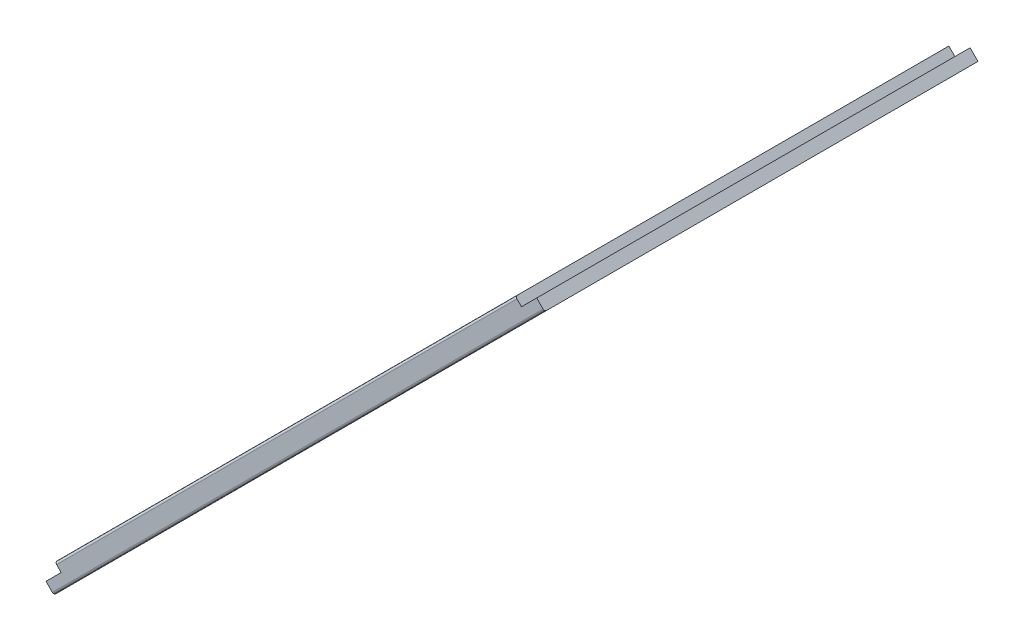
ISO-10303-21;
HEADER;
FILE_DESCRIPTION(('STEP AP214'),'2;1');
FILE_NAME('part.step','',(''),(''),'','','');
FILE_SCHEMA(('AUTOMOTIVE_DESIGN { 1 0 10303 214 1 1 1 1 }'));
ENDSEC;
DATA;
#1=APPLICATION_CONTEXT('core data for automotive mechanical design processes');
#2=APPLICATION_PROTOCOL_DEFINITION('international standard','automotive_design',2000,#1);
#3=PRODUCT_CONTEXT('',#1,'mechanical');
#4=PRODUCT('Part','Part','',(#3));
#5=PRODUCT_RELATED_PRODUCT_CATEGORY('part','',(#4));
#6=PRODUCT_DEFINITION_FORMATION('','',#4);
#7=PRODUCT_DEFINITION_CONTEXT('part definition',#1,'design');
#8=PRODUCT_DEFINITION('design','',#6,#7);
#9=PRODUCT_DEFINITION_SHAPE('','',#8);
#10=(LENGTH_UNIT() NAMED_UNIT(*) SI_UNIT(.MILLI.,.METRE.));
#11=(NAMED_UNIT(*) PLANE_ANGLE_UNIT() SI_UNIT($,.RADIAN.));
#12=(NAMED_UNIT(*) SI_UNIT($,.STERADIAN.) SOLID_ANGLE_UNIT());
#13=UNCERTAINTY_MEASURE_WITH_UNIT(LENGTH_MEASURE(1.E-05),#10,'distance_accuracy_value','');
#14=(GEOMETRIC_REPRESENTATION_CONTEXT(3) GLOBAL_UNCERTAINTY_ASSIGNED_CONTEXT((#13)) GLOBAL_UNIT_ASSIGNED_CONTEXT((#10,
#11,#12)) REPRESENTATION_CONTEXT('',''));
#15=CARTESIAN_POINT('',(0.,0.,0.));
#16=DIRECTION('',(0.,0.,1.));
#17=DIRECTION('',(1.,0.,0.));
#18=AXIS2_PLACEMENT_3D('',#15,#16,#17);
#19=CARTESIAN_POINT('',(181.793398282203,130.470353544371,8.59));
#20=DIRECTION('',(0.707106781186548,-0.707106781186548,0.));
#21=DIRECTION('',(0.707106781186548,0.707106781186548,0.));
#22=AXIS2_PLACEMENT_3D('',#19,#20,#21);
#23=PLANE('',#22);
#24=CARTESIAN_POINT('',(183.564844891609,132.241800153778,54.8));
#25=DIRECTION('',(0.707106781186548,-0.707106781186548,0.));
#26=DIRECTION('',(0.707106781186548,0.707106781186548,0.));
#27=AXIS2_PLACEMENT_3D('',#24,#25,#26);
#28=CIRCLE('',#27,2.00000000000001);
#29=CARTESIAN_POINT('',(184.979058453982,133.656013716151,54.8));
#30=VERTEX_POINT('',#29);
#31=EDGE_CURVE('E195',#30,#30,#28,.F.);
#32=ORIENTED_EDGE('',*,*,#31,.F.);
#33=EDGE_LOOP('',(#32));
#34=FACE_BOUND('',#33,.T.);
#35=CARTESIAN_POINT('',(183.564844891609,132.241800153778,27.5));
#36=DIRECTION('',(0.707106781186548,-0.707106781186548,0.));
#37=DIRECTION('',(0.707106781186548,0.707106781186548,0.));
#38=AXIS2_PLACEMENT_3D('',#35,#36,#37);
#39=CIRCLE('',#38,2.00000000000001);
#40=CARTESIAN_POINT('',(184.979058453982,133.656013716151,27.5));
#41=VERTEX_POINT('',#40);
#42=EDGE_CURVE('E198',#41,#41,#39,.F.);
#43=ORIENTED_EDGE('',*,*,#42,.F.);
#44=EDGE_LOOP('',(#43));
#45=FACE_BOUND('',#44,.T.);
#46=CARTESIAN_POINT('',(183.564844891609,132.241800153778,82.1));
#47=DIRECTION('',(0.707106781186548,-0.707106781186548,0.));
#48=DIRECTION('',(0.707106781186548,0.707106781186548,0.));
#49=AXIS2_PLACEMENT_3D('',#46,#47,#48);
#50=CIRCLE('',#49,2.);
#51=CARTESIAN_POINT('',(184.979058453982,133.656013716151,82.1));
#52=VERTEX_POINT('',#51);
#53=EDGE_CURVE('E122',#52,#52,#50,.F.);
#54=ORIENTED_EDGE('',*,*,#53,.F.);
#55=EDGE_LOOP('',(#54));
#56=FACE_BOUND('',#55,.T.);
#57=DIRECTION('',(0.,0.,1.));
#58=VECTOR('',#57,1.);
#59=CARTESIAN_POINT('',(181.793398282203,130.470353544371,8.59));
#60=LINE('',#59,#58);
#61=CARTESIAN_POINT('',(181.793398282203,130.470353544371,8.6));
#62=VERTEX_POINT('',#61);
#63=CARTESIAN_POINT('',(181.793398282203,130.470353544371,109.6));
#64=VERTEX_POINT('',#63);
#65=EDGE_CURVE('E159',#62,#64,#60,.T.);
#66=ORIENTED_EDGE('',*,*,#65,.T.);
#67=DIRECTION('',(-0.707106781186548,-0.707106781186548,0.));
#68=VECTOR('',#67,1.);
#69=CARTESIAN_POINT('',(25.6615223689158,-25.6615223689158,109.6));
#70=LINE('',#69,#68);
#71=CARTESIAN_POINT('',(185.328932188135,134.005887450304,109.6));
#72=VERTEX_POINT('',#71);
#73=EDGE_CURVE('E189',#72,#64,#70,.T.);
#74=ORIENTED_EDGE('',*,*,#73,.F.);
#75=DIRECTION('',(0.,0.,1.));
#76=VECTOR('',#75,1.);
#77=CARTESIAN_POINT('',(185.328932188135,134.005887450304,8.59));
#78=LINE('',#77,#76);
#79=CARTESIAN_POINT('',(185.328932188135,134.005887450304,8.6));
#80=VERTEX_POINT('',#79);
#81=EDGE_CURVE('E165',#80,#72,#78,.T.);
#82=ORIENTED_EDGE('',*,*,#81,.F.);
#83=DIRECTION('',(0.707106781186548,0.707106781186548,0.));
#84=VECTOR('',#83,1.);
#85=CARTESIAN_POINT('',(25.6565223689158,-25.6665223689158,8.6));
#86=LINE('',#85,#84);
#87=EDGE_CURVE('E178',#62,#80,#86,.T.);
#88=ORIENTED_EDGE('',*,*,#87,.F.);
#89=EDGE_LOOP('',(#66,#74,#82,#88));
#90=FACE_BOUND('',#89,.T.);
#91=ADVANCED_FACE('F33',(#34,#45,#56,#90),#23,.F.);
#92=CARTESIAN_POINT('',(180.379184719829,131.884567106744,8.59));
#93=DIRECTION('',(-0.707106781186554,-0.707106781186541,0.));
#94=DIRECTION('',(0.707106781186541,-0.707106781186554,0.));
#95=AXIS2_PLACEMENT_3D('',#92,#93,#94);
#96=PLANE('',#95);
#97=DIRECTION('',(0.,0.,-1.));
#98=VECTOR('',#97,1.);
#99=CARTESIAN_POINT('',(180.379184719829,131.884567106745,8.6));
#100=LINE('',#99,#98);
#101=CARTESIAN_POINT('',(180.379184719829,131.884567106745,109.1));
#102=VERTEX_POINT('',#101);
#103=CARTESIAN_POINT('',(180.379184719829,131.884567106745,8.6));
#104=VERTEX_POINT('',#103);
#105=EDGE_CURVE('E183',#102,#104,#100,.T.);
#106=ORIENTED_EDGE('',*,*,#105,.F.);
#107=CARTESIAN_POINT('',(180.732738110422,131.531013716152,109.1));
#108=DIRECTION('',(-0.707106781186554,-0.707106781186541,0.));
#109=DIRECTION('',(0.707106781186541,-0.707106781186554,0.));
#110=AXIS2_PLACEMENT_3D('',#107,#108,#109);
#111=CIRCLE('',#110,0.5);
#112=CARTESIAN_POINT('',(180.732738110422,131.531013716152,109.6));
#113=VERTEX_POINT('',#112);
#114=EDGE_CURVE('E154',#102,#113,#111,.F.);
#115=ORIENTED_EDGE('',*,*,#114,.T.);
#116=DIRECTION('',(-0.707106781186541,0.707106781186554,0.));
#117=VECTOR('',#116,1.);
#118=CARTESIAN_POINT('',(156.131875913289,156.131875913286,109.6));
#119=LINE('',#118,#117);
#120=EDGE_CURVE('E187',#64,#113,#119,.T.);
#121=ORIENTED_EDGE('',*,*,#120,.F.);
#122=ORIENTED_EDGE('',*,*,#65,.F.);
#123=DIRECTION('',(0.707106781186541,-0.707106781186554,0.));
#124=VECTOR('',#123,1.);
#125=CARTESIAN_POINT('',(156.126875913289,156.136875913286,8.6));
#126=LINE('',#125,#124);
#127=EDGE_CURVE('E175',#104,#62,#126,.T.);
#128=ORIENTED_EDGE('',*,*,#127,.F.);
#129=EDGE_LOOP('',(#106,#115,#121,#122,#128));
#130=FACE_BOUND('',#129,.T.);
#131=ADVANCED_FACE('F258',(#130),#96,.F.);
#132=CARTESIAN_POINT('',(185.328932188135,134.005887450304,8.59));
#133=DIRECTION('',(-0.707106781186553,-0.707106781186542,0.));
#134=DIRECTION('',(0.707106781186542,-0.707106781186553,0.));
#135=AXIS2_PLACEMENT_3D('',#132,#133,#134);
#136=PLANE('',#135);
#137=ORIENTED_EDGE('',*,*,#81,.T.);
#138=DIRECTION('',(-0.707106781186542,0.707106781186553,0.));
#139=VECTOR('',#138,1.);
#140=CARTESIAN_POINT('',(159.667409819221,159.667409819219,109.6));
#141=LINE('',#140,#139);
#142=CARTESIAN_POINT('',(186.813856428626,132.520963209813,109.6));
#143=VERTEX_POINT('',#142);
#144=EDGE_CURVE('E130',#143,#72,#141,.T.);
#145=ORIENTED_EDGE('',*,*,#144,.F.);
#146=CARTESIAN_POINT('',(186.813856428626,132.520963209813,109.1));
#147=DIRECTION('',(-0.707106781186553,-0.707106781186542,0.));
#148=DIRECTION('',(0.707106781186542,-0.707106781186553,0.));
#149=AXIS2_PLACEMENT_3D('',#146,#147,#148);
#150=CIRCLE('',#149,0.5);
#151=CARTESIAN_POINT('',(187.16740981922,132.167409819219,109.1));
#152=VERTEX_POINT('',#151);
#153=EDGE_CURVE('E126',#143,#152,#150,.F.);
#154=ORIENTED_EDGE('',*,*,#153,.T.);
#155=DIRECTION('',(0.,0.,1.));
#156=VECTOR('',#155,1.);
#157=CARTESIAN_POINT('',(187.16740981922,132.167409819219,109.6));
#158=LINE('',#157,#156);
#159=CARTESIAN_POINT('',(187.16740981922,132.167409819219,8.6));
#160=VERTEX_POINT('',#159);
#161=EDGE_CURVE('E115',#160,#152,#158,.T.);
#162=ORIENTED_EDGE('',*,*,#161,.F.);
#163=DIRECTION('',(0.707106781186542,-0.707106781186553,0.));
#164=VECTOR('',#163,1.);
#165=CARTESIAN_POINT('',(159.662409819221,159.672409819219,8.6));
#166=LINE('',#165,#164);
#167=EDGE_CURVE('E58',#80,#160,#166,.T.);
#168=ORIENTED_EDGE('',*,*,#167,.F.);
#169=EDGE_LOOP('',(#137,#145,#154,#162,#168));
#170=FACE_BOUND('',#169,.T.);
#171=ADVANCED_FACE('F128',(#170),#136,.F.);
#172=CARTESIAN_POINT('',(74.5296464556298,23.2066017177982,8.59));
#173=DIRECTION('',(0.707106781186545,-0.70710678118655,0.));
#174=DIRECTION('',(0.70710678118655,0.707106781186545,0.));
#175=AXIS2_PLACEMENT_3D('',#172,#173,#174);
#176=PLANE('',#175);
#177=CARTESIAN_POINT('',(72.7581998462231,21.4351551083915,54.8));
#178=DIRECTION('',(0.707106781186545,-0.70710678118655,0.));
#179=DIRECTION('',(0.70710678118655,0.707106781186545,0.));
#180=AXIS2_PLACEMENT_3D('',#177,#178,#179);
#181=CIRCLE('',#180,2.);
#182=CARTESIAN_POINT('',(74.1724134085962,22.8493686707646,54.8));
#183=VERTEX_POINT('',#182);
#184=EDGE_CURVE('E221',#183,#183,#181,.F.);
#185=ORIENTED_EDGE('',*,*,#184,.F.);
#186=EDGE_LOOP('',(#185));
#187=FACE_BOUND('',#186,.T.);
#188=CARTESIAN_POINT('',(72.7581998462231,21.4351551083915,82.1));
#189=DIRECTION('',(0.707106781186545,-0.70710678118655,0.));
#190=DIRECTION('',(0.70710678118655,0.707106781186545,0.));
#191=AXIS2_PLACEMENT_3D('',#188,#189,#190);
#192=CIRCLE('',#191,2.);
#193=CARTESIAN_POINT('',(74.1724134085962,22.8493686707646,82.1));
#194=VERTEX_POINT('',#193);
#195=EDGE_CURVE('E150',#194,#194,#192,.F.);
#196=ORIENTED_EDGE('',*,*,#195,.F.);
#197=EDGE_LOOP('',(#196));
#198=FACE_BOUND('',#197,.T.);
#199=CARTESIAN_POINT('',(72.7581998462231,21.4351551083915,27.5));
#200=DIRECTION('',(0.707106781186545,-0.70710678118655,0.));
#201=DIRECTION('',(0.70710678118655,0.707106781186545,0.));
#202=AXIS2_PLACEMENT_3D('',#199,#200,#201);
#203=CIRCLE('',#202,2.00000000000001);
#204=CARTESIAN_POINT('',(74.1724134085962,22.8493686707646,27.5));
#205=VERTEX_POINT('',#204);
#206=EDGE_CURVE('E201',#205,#205,#203,.F.);
#207=ORIENTED_EDGE('',*,*,#206,.F.);
#208=EDGE_LOOP('',(#207));
#209=FACE_BOUND('',#208,.T.);
#210=DIRECTION('',(0.,0.,1.));
#211=VECTOR('',#210,1.);
#212=CARTESIAN_POINT('',(70.994112549697,19.6710678118655,8.59));
#213=LINE('',#212,#211);
#214=CARTESIAN_POINT('',(70.994112549697,19.6710678118655,8.6));
#215=VERTEX_POINT('',#214);
#216=CARTESIAN_POINT('',(70.994112549697,19.6710678118655,109.6));
#217=VERTEX_POINT('',#216);
#218=EDGE_CURVE('E135',#215,#217,#213,.T.);
#219=ORIENTED_EDGE('',*,*,#218,.T.);
#220=DIRECTION('',(-0.70710678118655,-0.707106781186545,0.));
#221=VECTOR('',#220,1.);
#222=CARTESIAN_POINT('',(25.6615223689155,-25.6615223689157,109.6));
#223=LINE('',#222,#221);
#224=CARTESIAN_POINT('',(74.5296464556298,23.2066017177982,109.6));
#225=VERTEX_POINT('',#224);
#226=EDGE_CURVE('E214',#225,#217,#223,.T.);
#227=ORIENTED_EDGE('',*,*,#226,.F.);
#228=DIRECTION('',(0.,0.,1.));
#229=VECTOR('',#228,1.);
#230=CARTESIAN_POINT('',(74.5296464556298,23.2066017177982,8.59));
#231=LINE('',#230,#229);
#232=CARTESIAN_POINT('',(74.5296464556298,23.2066017177982,8.6));
#233=VERTEX_POINT('',#232);
#234=EDGE_CURVE('E37',#233,#225,#231,.T.);
#235=ORIENTED_EDGE('',*,*,#234,.F.);
#236=DIRECTION('',(0.70710678118655,0.707106781186545,0.));
#237=VECTOR('',#236,1.);
#238=CARTESIAN_POINT('',(25.6565223689155,-25.6665223689157,8.6));
#239=LINE('',#238,#237);
#240=EDGE_CURVE('E302',#215,#233,#239,.T.);
#241=ORIENTED_EDGE('',*,*,#240,.F.);
#242=EDGE_LOOP('',(#219,#227,#235,#241));
#243=FACE_BOUND('',#242,.T.);
#244=ADVANCED_FACE('F274',(#187,#198,#209,#243),#176,.F.);
#245=CARTESIAN_POINT('',(70.994112549697,19.6710678118655,8.59));
#246=DIRECTION('',(0.707106781186545,0.70710678118655,0.));
#247=DIRECTION('',(-0.70710678118655,0.707106781186545,0.));
#248=AXIS2_PLACEMENT_3D('',#245,#246,#247);
#249=PLANE('',#248);
#250=DIRECTION('',(0.,0.,-1.));
#251=VECTOR('',#250,1.);
#252=CARTESIAN_POINT('',(72.8325901807819,17.8325901807805,109.6));
#253=LINE('',#252,#251);
#254=CARTESIAN_POINT('',(72.8325901807819,17.8325901807805,109.1));
#255=VERTEX_POINT('',#254);
#256=CARTESIAN_POINT('',(72.8325901807819,17.8325901807805,8.6));
#257=VERTEX_POINT('',#256);
#258=EDGE_CURVE('E123',#255,#257,#253,.T.);
#259=ORIENTED_EDGE('',*,*,#258,.F.);
#260=CARTESIAN_POINT('',(72.4790367901887,18.1861435713738,109.1));
#261=DIRECTION('',(0.707106781186545,0.70710678118655,0.));
#262=DIRECTION('',(-0.70710678118655,0.707106781186545,0.));
#263=AXIS2_PLACEMENT_3D('',#260,#261,#262);
#264=CIRCLE('',#263,0.5);
#265=CARTESIAN_POINT('',(72.4790367901887,18.1861435713738,109.6));
#266=VERTEX_POINT('',#265);
#267=EDGE_CURVE('E134',#255,#266,#264,.F.);
#268=ORIENTED_EDGE('',*,*,#267,.T.);
#269=DIRECTION('',(0.70710678118655,-0.707106781186545,0.));
#270=VECTOR('',#269,1.);
#271=CARTESIAN_POINT('',(45.332590180781,45.3325901807813,109.6));
#272=LINE('',#271,#270);
#273=EDGE_CURVE('E186',#217,#266,#272,.T.);
#274=ORIENTED_EDGE('',*,*,#273,.F.);
#275=ORIENTED_EDGE('',*,*,#218,.F.);
#276=DIRECTION('',(-0.70710678118655,0.707106781186545,0.));
#277=VECTOR('',#276,1.);
#278=CARTESIAN_POINT('',(45.327590180781,45.3375901807813,8.6));
#279=LINE('',#278,#277);
#280=EDGE_CURVE('E50',#257,#215,#279,.T.);
#281=ORIENTED_EDGE('',*,*,#280,.F.);
#282=EDGE_LOOP('',(#259,#268,#274,#275,#281));
#283=FACE_BOUND('',#282,.T.);
#284=ADVANCED_FACE('F305',(#283),#249,.F.);
#285=CARTESIAN_POINT('',(73.1154328932567,24.6208152801713,8.59));
#286=DIRECTION('',(0.707106781186548,0.707106781186547,0.));
#287=DIRECTION('',(-0.707106781186547,0.707106781186548,0.));
#288=AXIS2_PLACEMENT_3D('',#285,#286,#287);
#289=PLANE('',#288);
#290=ORIENTED_EDGE('',*,*,#234,.T.);
#291=DIRECTION('',(0.707106781186547,-0.707106781186548,0.));
#292=VECTOR('',#291,1.);
#293=CARTESIAN_POINT('',(48.8681240867141,48.868124086714,109.6));
#294=LINE('',#293,#292);
#295=CARTESIAN_POINT('',(73.4689862838498,24.2672618895782,109.6));
#296=VERTEX_POINT('',#295);
#297=EDGE_CURVE('E190',#296,#225,#294,.T.);
#298=ORIENTED_EDGE('',*,*,#297,.F.);
#299=CARTESIAN_POINT('',(73.4689862838498,24.2672618895781,109.1));
#300=DIRECTION('',(0.707106781186548,0.707106781186547,0.));
#301=DIRECTION('',(-0.707106781186547,0.707106781186548,0.));
#302=AXIS2_PLACEMENT_3D('',#299,#300,#301);
#303=CIRCLE('',#302,0.5);
#304=CARTESIAN_POINT('',(73.1154328932566,24.6208152801714,109.1));
#305=VERTEX_POINT('',#304);
#306=EDGE_CURVE('E151',#296,#305,#303,.F.);
#307=ORIENTED_EDGE('',*,*,#306,.T.);
#308=DIRECTION('',(0.,0.,1.));
#309=VECTOR('',#308,1.);
#310=CARTESIAN_POINT('',(73.1154328932567,24.6208152801713,8.59));
#311=LINE('',#310,#309);
#312=CARTESIAN_POINT('',(73.1154328932566,24.6208152801714,8.6));
#313=VERTEX_POINT('',#312);
#314=EDGE_CURVE('E182',#313,#305,#311,.T.);
#315=ORIENTED_EDGE('',*,*,#314,.F.);
#316=DIRECTION('',(-0.707106781186547,0.707106781186548,0.));
#317=VECTOR('',#316,1.);
#318=CARTESIAN_POINT('',(48.8631240867141,48.873124086714,8.6));
#319=LINE('',#318,#317);
#320=EDGE_CURVE('E179',#233,#313,#319,.T.);
#321=ORIENTED_EDGE('',*,*,#320,.F.);
#322=EDGE_LOOP('',(#290,#298,#307,#315,#321));
#323=FACE_BOUND('',#322,.T.);
#324=ADVANCED_FACE('F213',(#323),#289,.F.);
#325=CARTESIAN_POINT('',(-0.01000000000001,0.,8.6));
#326=DIRECTION('',(0.,0.,1.));
#327=DIRECTION('',(1.,0.,0.));
#328=AXIS2_PLACEMENT_3D('',#325,#326,#327);
#329=PLANE('',#328);
#330=DIRECTION('',(0.707106781186544,0.707106781186551,0.));
#331=VECTOR('',#330,1.);
#332=CARTESIAN_POINT('',(205.,150.,8.6));
#333=LINE('',#332,#331);
#334=EDGE_CURVE('E120',#257,#160,#333,.T.);
#335=ORIENTED_EDGE('',*,*,#334,.F.);
#336=ORIENTED_EDGE('',*,*,#280,.T.);
#337=ORIENTED_EDGE('',*,*,#240,.T.);
#338=ORIENTED_EDGE('',*,*,#320,.T.);
#339=DIRECTION('',(0.707106781186543,0.707106781186551,0.));
#340=VECTOR('',#339,1.);
#341=CARTESIAN_POINT('',(55.437763363593,6.94314575050766,8.6));
#342=LINE('',#341,#340);
#343=EDGE_CURVE('E144',#313,#104,#342,.T.);
#344=ORIENTED_EDGE('',*,*,#343,.T.);
#345=ORIENTED_EDGE('',*,*,#127,.T.);
#346=ORIENTED_EDGE('',*,*,#87,.T.);
#347=ORIENTED_EDGE('',*,*,#167,.T.);
#348=EDGE_LOOP('',(#335,#336,#337,#338,#344,#345,#346,#347));
#349=FACE_BOUND('',#348,.T.);
#350=ADVANCED_FACE('F308',(#349),#329,.F.);
#351=CARTESIAN_POINT('',(55.437763363593,6.94314575050766,8.6));
#352=DIRECTION('',(0.707106781186551,-0.707106781186543,0.));
#353=DIRECTION('',(0.707106781186544,0.707106781186552,0.));
#354=AXIS2_PLACEMENT_3D('',#351,#352,#353);
#355=PLANE('',#354);
#356=ORIENTED_EDGE('',*,*,#343,.F.);
#357=ORIENTED_EDGE('',*,*,#314,.T.);
#358=DIRECTION('',(0.707106781186544,0.707106781186552,0.));
#359=VECTOR('',#358,1.);
#360=CARTESIAN_POINT('',(55.437763363593,6.94314575050766,109.1));
#361=LINE('',#360,#359);
#362=EDGE_CURVE('E139',#305,#102,#361,.T.);
#363=ORIENTED_EDGE('',*,*,#362,.T.);
#364=ORIENTED_EDGE('',*,*,#105,.T.);
#365=EDGE_LOOP('',(#356,#357,#363,#364));
#366=FACE_BOUND('',#365,.T.);
#367=ADVANCED_FACE('F376',(#366),#355,.F.);
#368=CARTESIAN_POINT('',(0.,0.,109.6));
#369=DIRECTION('',(0.,0.,-1.));
#370=DIRECTION('',(-1.,0.,0.));
#371=AXIS2_PLACEMENT_3D('',#368,#369,#370);
#372=PLANE('',#371);
#373=ORIENTED_EDGE('',*,*,#226,.T.);
#374=ORIENTED_EDGE('',*,*,#273,.T.);
#375=DIRECTION('',(0.707106781186544,0.707106781186551,0.));
#376=VECTOR('',#375,1.);
#377=CARTESIAN_POINT('',(27.1464466094079,-27.1464466094076,109.6));
#378=LINE('',#377,#376);
#379=EDGE_CURVE('E202',#266,#143,#378,.T.);
#380=ORIENTED_EDGE('',*,*,#379,.T.);
#381=ORIENTED_EDGE('',*,*,#144,.T.);
#382=ORIENTED_EDGE('',*,*,#73,.T.);
#383=ORIENTED_EDGE('',*,*,#120,.T.);
#384=DIRECTION('',(0.707106781186544,0.707106781186552,0.));
#385=VECTOR('',#384,1.);
#386=CARTESIAN_POINT('',(24.6008621971363,-24.600862197136,109.6));
#387=LINE('',#386,#385);
#388=EDGE_CURVE('E142',#113,#296,#387,.F.);
#389=ORIENTED_EDGE('',*,*,#388,.T.);
#390=ORIENTED_EDGE('',*,*,#297,.T.);
#391=EDGE_LOOP('',(#373,#374,#380,#381,#382,#383,#389,#390));
#392=FACE_BOUND('',#391,.T.);
#393=ADVANCED_FACE('F35',(#392),#372,.F.);
#394=CARTESIAN_POINT('',(205.,150.,109.6));
#395=DIRECTION('',(-0.707106781186551,0.707106781186544,0.));
#396=DIRECTION('',(-0.707106781186544,-0.707106781186551,0.));
#397=AXIS2_PLACEMENT_3D('',#394,#395,#396);
#398=PLANE('',#397);
#399=CARTESIAN_POINT('',(74.596677477308,19.5966774773066,82.1));
#400=DIRECTION('',(0.707106781186551,-0.707106781186544,0.));
#401=DIRECTION('',(-0.707106781186544,-0.707106781186551,0.));
#402=AXIS2_PLACEMENT_3D('',#399,#400,#401);
#403=CIRCLE('',#402,2.);
#404=CARTESIAN_POINT('',(73.1824639149349,18.1824639149335,82.1));
#405=VERTEX_POINT('',#404);
#406=EDGE_CURVE('E11',#405,#405,#403,.T.);
#407=ORIENTED_EDGE('',*,*,#406,.F.);
#408=EDGE_LOOP('',(#407));
#409=FACE_BOUND('',#408,.T.);
#410=CARTESIAN_POINT('',(74.596677477308,19.5966774773066,54.8));
#411=DIRECTION('',(0.707106781186551,-0.707106781186544,0.));
#412=DIRECTION('',(-0.707106781186544,-0.707106781186551,0.));
#413=AXIS2_PLACEMENT_3D('',#410,#411,#412);
#414=CIRCLE('',#413,2.);
#415=CARTESIAN_POINT('',(73.1824639149349,18.1824639149335,54.8));
#416=VERTEX_POINT('',#415);
#417=EDGE_CURVE('E42',#416,#416,#414,.T.);
#418=ORIENTED_EDGE('',*,*,#417,.F.);
#419=EDGE_LOOP('',(#418));
#420=FACE_BOUND('',#419,.T.);
#421=CARTESIAN_POINT('',(74.596677477308,19.5966774773066,27.5));
#422=DIRECTION('',(0.707106781186551,-0.707106781186544,0.));
#423=DIRECTION('',(-0.707106781186544,-0.707106781186551,0.));
#424=AXIS2_PLACEMENT_3D('',#421,#422,#423);
#425=CIRCLE('',#424,2.00000000000001);
#426=CARTESIAN_POINT('',(73.1824639149349,18.1824639149335,27.5));
#427=VERTEX_POINT('',#426);
#428=EDGE_CURVE('E227',#427,#427,#425,.T.);
#429=ORIENTED_EDGE('',*,*,#428,.F.);
#430=EDGE_LOOP('',(#429));
#431=FACE_BOUND('',#430,.T.);
#432=CARTESIAN_POINT('',(185.403322522694,130.403322522693,27.5));
#433=DIRECTION('',(0.707106781186551,-0.707106781186544,0.));
#434=DIRECTION('',(0.707106781186544,0.707106781186551,0.));
#435=AXIS2_PLACEMENT_3D('',#432,#433,#434);
#436=CIRCLE('',#435,2.00000000000001);
#437=CARTESIAN_POINT('',(186.817536085067,131.817536085067,27.5));
#438=VERTEX_POINT('',#437);
#439=EDGE_CURVE('E230',#438,#438,#436,.T.);
#440=ORIENTED_EDGE('',*,*,#439,.F.);
#441=EDGE_LOOP('',(#440));
#442=FACE_BOUND('',#441,.T.);
#443=CARTESIAN_POINT('',(185.403322522694,130.403322522693,54.8));
#444=DIRECTION('',(0.707106781186551,-0.707106781186544,0.));
#445=DIRECTION('',(0.707106781186544,0.707106781186551,0.));
#446=AXIS2_PLACEMENT_3D('',#443,#444,#445);
#447=CIRCLE('',#446,2.00000000000001);
#448=CARTESIAN_POINT('',(186.817536085067,131.817536085067,54.8));
#449=VERTEX_POINT('',#448);
#450=EDGE_CURVE('E223',#449,#449,#447,.T.);
#451=ORIENTED_EDGE('',*,*,#450,.F.);
#452=EDGE_LOOP('',(#451));
#453=FACE_BOUND('',#452,.T.);
#454=CARTESIAN_POINT('',(185.403322522694,130.403322522693,82.1));
#455=DIRECTION('',(0.707106781186551,-0.707106781186544,0.));
#456=DIRECTION('',(0.707106781186544,0.707106781186551,0.));
#457=AXIS2_PLACEMENT_3D('',#454,#455,#456);
#458=CIRCLE('',#457,2.);
#459=CARTESIAN_POINT('',(186.817536085067,131.817536085067,82.1));
#460=VERTEX_POINT('',#459);
#461=EDGE_CURVE('E203',#460,#460,#458,.T.);
#462=ORIENTED_EDGE('',*,*,#461,.F.);
#463=EDGE_LOOP('',(#462));
#464=FACE_BOUND('',#463,.T.);
#465=DIRECTION('',(0.707106781186544,0.707106781186551,0.));
#466=VECTOR('',#465,1.);
#467=CARTESIAN_POINT('',(205.,150.,109.1));
#468=LINE('',#467,#466);
#469=EDGE_CURVE('E119',#152,#255,#468,.F.);
#470=ORIENTED_EDGE('',*,*,#469,.T.);
#471=ORIENTED_EDGE('',*,*,#258,.T.);
#472=ORIENTED_EDGE('',*,*,#334,.T.);
#473=ORIENTED_EDGE('',*,*,#161,.T.);
#474=EDGE_LOOP('',(#470,#471,#472,#473));
#475=FACE_BOUND('',#474,.T.);
#476=ADVANCED_FACE('F117',(#409,#420,#431,#442,#453,#464,#475),#398,.F.);
#477=CARTESIAN_POINT('',(67.5256096654425,26.667745289172,82.1));
#478=DIRECTION('',(0.707106781186551,-0.707106781186544,0.));
#479=DIRECTION('',(0.707106781186544,0.707106781186551,0.));
#480=AXIS2_PLACEMENT_3D('',#477,#478,#479);
#481=CYLINDRICAL_SURFACE('',#480,2.);
#482=ORIENTED_EDGE('',*,*,#195,.T.);
#483=EDGE_LOOP('',(#482));
#484=FACE_BOUND('',#483,.T.);
#485=ORIENTED_EDGE('',*,*,#406,.T.);
#486=EDGE_LOOP('',(#485));
#487=FACE_BOUND('',#486,.T.);
#488=ADVANCED_FACE('F239',(#484,#487),#481,.F.);
#489=CARTESIAN_POINT('',(67.5256096654425,26.667745289172,54.8));
#490=DIRECTION('',(0.707106781186551,-0.707106781186544,0.));
#491=DIRECTION('',(0.707106781186544,0.707106781186551,0.));
#492=AXIS2_PLACEMENT_3D('',#489,#490,#491);
#493=CYLINDRICAL_SURFACE('',#492,2.);
#494=ORIENTED_EDGE('',*,*,#184,.T.);
#495=EDGE_LOOP('',(#494));
#496=FACE_BOUND('',#495,.T.);
#497=ORIENTED_EDGE('',*,*,#417,.T.);
#498=EDGE_LOOP('',(#497));
#499=FACE_BOUND('',#498,.T.);
#500=ADVANCED_FACE('F280',(#496,#499),#493,.F.);
#501=CARTESIAN_POINT('',(67.5256096654425,26.667745289172,27.5));
#502=DIRECTION('',(0.707106781186551,-0.707106781186544,0.));
#503=DIRECTION('',(0.707106781186544,0.707106781186551,0.));
#504=AXIS2_PLACEMENT_3D('',#501,#502,#503);
#505=CYLINDRICAL_SURFACE('',#504,2.00000000000001);
#506=ORIENTED_EDGE('',*,*,#206,.T.);
#507=EDGE_LOOP('',(#506));
#508=FACE_BOUND('',#507,.T.);
#509=ORIENTED_EDGE('',*,*,#428,.T.);
#510=EDGE_LOOP('',(#509));
#511=FACE_BOUND('',#510,.T.);
#512=ADVANCED_FACE('F269',(#508,#511),#505,.F.);
#513=CARTESIAN_POINT('',(178.332254710828,137.474390334559,27.5));
#514=DIRECTION('',(0.707106781186551,-0.707106781186544,0.));
#515=DIRECTION('',(0.707106781186544,0.707106781186551,0.));
#516=AXIS2_PLACEMENT_3D('',#513,#514,#515);
#517=CYLINDRICAL_SURFACE('',#516,2.00000000000001);
#518=ORIENTED_EDGE('',*,*,#42,.T.);
#519=EDGE_LOOP('',(#518));
#520=FACE_BOUND('',#519,.T.);
#521=ORIENTED_EDGE('',*,*,#439,.T.);
#522=EDGE_LOOP('',(#521));
#523=FACE_BOUND('',#522,.T.);
#524=ADVANCED_FACE('F253',(#520,#523),#517,.F.);
#525=CARTESIAN_POINT('',(178.332254710828,137.474390334559,54.8));
#526=DIRECTION('',(0.707106781186551,-0.707106781186544,0.));
#527=DIRECTION('',(0.707106781186544,0.707106781186551,0.));
#528=AXIS2_PLACEMENT_3D('',#525,#526,#527);
#529=CYLINDRICAL_SURFACE('',#528,2.00000000000001);
#530=ORIENTED_EDGE('',*,*,#31,.T.);
#531=EDGE_LOOP('',(#530));
#532=FACE_BOUND('',#531,.T.);
#533=ORIENTED_EDGE('',*,*,#450,.T.);
#534=EDGE_LOOP('',(#533));
#535=FACE_BOUND('',#534,.T.);
#536=ADVANCED_FACE('F235',(#532,#535),#529,.F.);
#537=CARTESIAN_POINT('',(178.332254710828,137.474390334559,82.1));
#538=DIRECTION('',(0.707106781186551,-0.707106781186544,0.));
#539=DIRECTION('',(0.707106781186544,0.707106781186551,0.));
#540=AXIS2_PLACEMENT_3D('',#537,#538,#539);
#541=CYLINDRICAL_SURFACE('',#540,2.);
#542=ORIENTED_EDGE('',*,*,#53,.T.);
#543=EDGE_LOOP('',(#542));
#544=FACE_BOUND('',#543,.T.);
#545=ORIENTED_EDGE('',*,*,#461,.T.);
#546=EDGE_LOOP('',(#545));
#547=FACE_BOUND('',#546,.T.);
#548=ADVANCED_FACE('F244',(#544,#547),#541,.F.);
#549=CARTESIAN_POINT('',(27.1464466094078,-27.1464466094075,109.1));
#550=DIRECTION('',(0.707106781186544,0.707106781186551,0.));
#551=DIRECTION('',(-0.707106781186551,0.707106781186544,0.));
#552=AXIS2_PLACEMENT_3D('',#549,#550,#551);
#553=CYLINDRICAL_SURFACE('',#552,0.5);
#554=ORIENTED_EDGE('',*,*,#267,.F.);
#555=ORIENTED_EDGE('',*,*,#469,.F.);
#556=ORIENTED_EDGE('',*,*,#153,.F.);
#557=ORIENTED_EDGE('',*,*,#379,.F.);
#558=EDGE_LOOP('',(#554,#555,#556,#557));
#559=FACE_BOUND('',#558,.T.);
#560=ADVANCED_FACE('F137',(#559),#553,.T.);
#561=CARTESIAN_POINT('',(55.7913167541863,6.58959235991438,109.1));
#562=DIRECTION('',(0.707106781186544,0.707106781186552,0.));
#563=DIRECTION('',(-0.707106781186552,0.707106781186544,0.));
#564=AXIS2_PLACEMENT_3D('',#561,#562,#563);
#565=CYLINDRICAL_SURFACE('',#564,0.5);
#566=ORIENTED_EDGE('',*,*,#306,.F.);
#567=ORIENTED_EDGE('',*,*,#388,.F.);
#568=ORIENTED_EDGE('',*,*,#114,.F.);
#569=ORIENTED_EDGE('',*,*,#362,.F.);
#570=EDGE_LOOP('',(#566,#567,#568,#569));
#571=FACE_BOUND('',#570,.T.);
#572=ADVANCED_FACE('F209',(#571),#565,.T.);
#573=CLOSED_SHELL('',(#91,#131,#171,#244,#284,#324,#350,#367,#393,#476,#488,#500,#512,#524,#536,
#548,#560,#572));
#574=MANIFOLD_SOLID_BREP('B2',#573);
#575=ADVANCED_BREP_SHAPE_REPRESENTATION('',(#18,#574),#14);
#576=SHAPE_DEFINITION_REPRESENTATION(#9,#575);
ENDSEC;
END-ISO-10303-21;
